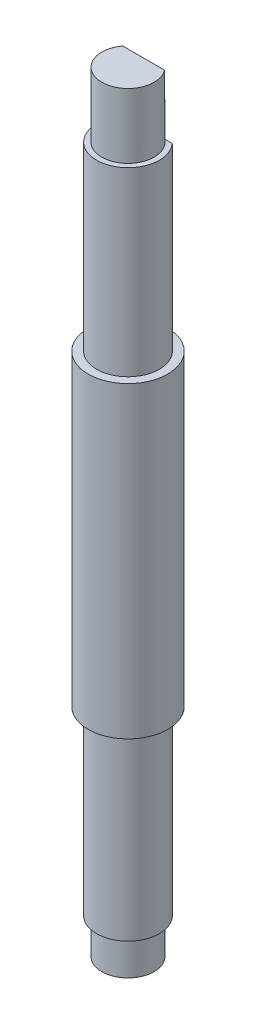
ISO-10303-21;
HEADER;
FILE_DESCRIPTION(('STEP AP214'),'2;1');
FILE_NAME('part.step','',(''),(''),'','','');
FILE_SCHEMA(('AUTOMOTIVE_DESIGN { 1 0 10303 214 1 1 1 1 }'));
ENDSEC;
DATA;
#1=APPLICATION_CONTEXT('core data for automotive mechanical design processes');
#2=APPLICATION_PROTOCOL_DEFINITION('international standard','automotive_design',2000,#1);
#3=PRODUCT_CONTEXT('',#1,'mechanical');
#4=PRODUCT('Part','Part','',(#3));
#5=PRODUCT_RELATED_PRODUCT_CATEGORY('part','',(#4));
#6=PRODUCT_DEFINITION_FORMATION('','',#4);
#7=PRODUCT_DEFINITION_CONTEXT('part definition',#1,'design');
#8=PRODUCT_DEFINITION('design','',#6,#7);
#9=PRODUCT_DEFINITION_SHAPE('','',#8);
#10=(LENGTH_UNIT() NAMED_UNIT(*) SI_UNIT(.MILLI.,.METRE.));
#11=(NAMED_UNIT(*) PLANE_ANGLE_UNIT() SI_UNIT($,.RADIAN.));
#12=(NAMED_UNIT(*) SI_UNIT($,.STERADIAN.) SOLID_ANGLE_UNIT());
#13=UNCERTAINTY_MEASURE_WITH_UNIT(LENGTH_MEASURE(1.E-05),#10,'distance_accuracy_value','');
#14=(GEOMETRIC_REPRESENTATION_CONTEXT(3) GLOBAL_UNCERTAINTY_ASSIGNED_CONTEXT((#13)) GLOBAL_UNIT_ASSIGNED_CONTEXT((#10,
#11,#12)) REPRESENTATION_CONTEXT('',''));
#15=CARTESIAN_POINT('',(0.,0.,0.));
#16=DIRECTION('',(0.,0.,1.));
#17=DIRECTION('',(1.,0.,0.));
#18=AXIS2_PLACEMENT_3D('',#15,#16,#17);
#19=CARTESIAN_POINT('',(-1.11803398874989,-8.08600449930836,-1.));
#20=DIRECTION('',(0.,0.,1.));
#21=DIRECTION('',(1.,0.,0.));
#22=AXIS2_PLACEMENT_3D('',#19,#20,#21);
#23=PLANE('',#22);
#24=DIRECTION('',(-1.,0.,0.));
#25=VECTOR('',#24,1.);
#26=CARTESIAN_POINT('',(-1.1180339887499,4.55528334816956,-1.));
#27=LINE('',#26,#25);
#28=CARTESIAN_POINT('',(0.75,4.55528334816956,-1.));
#29=VERTEX_POINT('',#28);
#30=CARTESIAN_POINT('',(-0.749999999999999,4.55528334816956,-1.));
#31=VERTEX_POINT('',#30);
#32=EDGE_CURVE('E12',#29,#31,#27,.T.);
#33=ORIENTED_EDGE('',*,*,#32,.F.);
#34=DIRECTION('',(0.,1.,0.));
#35=VECTOR('',#34,1.);
#36=CARTESIAN_POINT('',(0.75,5.95528334816956,-1.));
#37=LINE('',#36,#35);
#38=CARTESIAN_POINT('',(0.75,2.85528334816956,-1.));
#39=VERTEX_POINT('',#38);
#40=EDGE_CURVE('E164',#29,#39,#37,.F.);
#41=ORIENTED_EDGE('',*,*,#40,.T.);
#42=DIRECTION('',(-1.,0.,0.));
#43=VECTOR('',#42,1.);
#44=CARTESIAN_POINT('',(0.,2.85528334816956,-1.));
#45=LINE('',#44,#43);
#46=CARTESIAN_POINT('',(1.11803398874989,2.85528334816956,-1.));
#47=VERTEX_POINT('',#46);
#48=EDGE_CURVE('E165',#47,#39,#45,.T.);
#49=ORIENTED_EDGE('',*,*,#48,.F.);
#50=DIRECTION('',(0.,1.,0.));
#51=VECTOR('',#50,1.);
#52=CARTESIAN_POINT('',(1.1180339887499,-8.08600449930836,-1.));
#53=LINE('',#52,#51);
#54=CARTESIAN_POINT('',(1.1180339887499,-5.79471665183044,-1.));
#55=VERTEX_POINT('',#54);
#56=EDGE_CURVE('E153',#55,#47,#53,.T.);
#57=ORIENTED_EDGE('',*,*,#56,.F.);
#58=DIRECTION('',(-1.,0.,0.));
#59=VECTOR('',#58,1.);
#60=CARTESIAN_POINT('',(-1.11803398874989,-5.79471665183044,-1.));
#61=LINE('',#60,#59);
#62=CARTESIAN_POINT('',(-1.1180339887499,-5.79471665183044,-1.));
#63=VERTEX_POINT('',#62);
#64=EDGE_CURVE('E156',#55,#63,#61,.T.);
#65=ORIENTED_EDGE('',*,*,#64,.T.);
#66=DIRECTION('',(0.,1.,0.));
#67=VECTOR('',#66,1.);
#68=CARTESIAN_POINT('',(-1.11803398874989,-8.08600449930836,-1.));
#69=LINE('',#68,#67);
#70=CARTESIAN_POINT('',(-1.1180339887499,2.85528334816956,-1.));
#71=VERTEX_POINT('',#70);
#72=EDGE_CURVE('E152',#63,#71,#69,.T.);
#73=ORIENTED_EDGE('',*,*,#72,.T.);
#74=CARTESIAN_POINT('',(-0.75,2.85528334816956,-1.));
#75=VERTEX_POINT('',#74);
#76=EDGE_CURVE('E161',#75,#71,#45,.T.);
#77=ORIENTED_EDGE('',*,*,#76,.F.);
#78=DIRECTION('',(0.,1.,0.));
#79=VECTOR('',#78,1.);
#80=CARTESIAN_POINT('',(-0.75,5.95528334816956,-1.));
#81=LINE('',#80,#79);
#82=EDGE_CURVE('E159',#75,#31,#81,.T.);
#83=ORIENTED_EDGE('',*,*,#82,.T.);
#84=EDGE_LOOP('',(#33,#41,#49,#57,#65,#73,#77,#83));
#85=FACE_BOUND('',#84,.T.);
#86=ADVANCED_FACE('F37',(#85),#23,.F.);
#87=CARTESIAN_POINT('',(0.,5.95528334816956,0.));
#88=DIRECTION('',(0.,1.,0.));
#89=DIRECTION('',(-1.,0.,0.));
#90=AXIS2_PLACEMENT_3D('',#87,#88,#89);
#91=CYLINDRICAL_SURFACE('',#90,1.5);
#92=CARTESIAN_POINT('',(0.,-20.4947166518304,0.));
#93=DIRECTION('',(0.,1.,0.));
#94=DIRECTION('',(-1.,0.,0.));
#95=AXIS2_PLACEMENT_3D('',#92,#93,#94);
#96=CIRCLE('',#95,1.5);
#97=CARTESIAN_POINT('',(-1.11803398874989,-20.4947166518304,-0.999999999999999));
#98=VERTEX_POINT('',#97);
#99=CARTESIAN_POINT('',(1.1180339887499,-20.4947166518304,-1.));
#100=VERTEX_POINT('',#99);
#101=EDGE_CURVE('E192',#98,#100,#96,.T.);
#102=ORIENTED_EDGE('',*,*,#101,.F.);
#103=DIRECTION('',(0.,-1.,0.));
#104=VECTOR('',#103,1.);
#105=CARTESIAN_POINT('',(-1.11803398874989,-18.2034288043525,-1.));
#106=LINE('',#105,#104);
#107=CARTESIAN_POINT('',(-1.11803398874989,-29.1447166518304,-1.));
#108=VERTEX_POINT('',#107);
#109=EDGE_CURVE('E143',#98,#108,#106,.T.);
#110=ORIENTED_EDGE('',*,*,#109,.T.);
#111=CARTESIAN_POINT('',(0.,-29.1447166518304,0.));
#112=DIRECTION('',(0.,1.,0.));
#113=DIRECTION('',(-1.,0.,0.));
#114=AXIS2_PLACEMENT_3D('',#111,#112,#113);
#115=CIRCLE('',#114,1.5);
#116=CARTESIAN_POINT('',(1.1180339887499,-29.1447166518304,-1.));
#117=VERTEX_POINT('',#116);
#118=EDGE_CURVE('E167',#108,#117,#115,.T.);
#119=ORIENTED_EDGE('',*,*,#118,.T.);
#120=DIRECTION('',(0.,-1.,0.));
#121=VECTOR('',#120,1.);
#122=CARTESIAN_POINT('',(1.1180339887499,-18.2034288043525,-1.));
#123=LINE('',#122,#121);
#124=EDGE_CURVE('E59',#100,#117,#123,.T.);
#125=ORIENTED_EDGE('',*,*,#124,.F.);
#126=EDGE_LOOP('',(#102,#110,#119,#125));
#127=FACE_BOUND('',#126,.T.);
#128=ADVANCED_FACE('F39',(#127),#91,.T.);
#129=CARTESIAN_POINT('',(0.,-30.8447166518304,0.));
#130=DIRECTION('',(0.,-1.,0.));
#131=DIRECTION('',(1.,0.,0.));
#132=AXIS2_PLACEMENT_3D('',#129,#130,#131);
#133=PLANE('',#132);
#134=CARTESIAN_POINT('',(0.,-30.8447166518304,0.));
#135=DIRECTION('',(0.,1.,0.));
#136=DIRECTION('',(-1.,0.,0.));
#137=AXIS2_PLACEMENT_3D('',#134,#135,#136);
#138=CIRCLE('',#137,1.25);
#139=CARTESIAN_POINT('',(-0.749999999999995,-30.8447166518304,-1.));
#140=VERTEX_POINT('',#139);
#141=CARTESIAN_POINT('',(0.750000000000004,-30.8447166518304,-1.));
#142=VERTEX_POINT('',#141);
#143=EDGE_CURVE('E173',#140,#142,#138,.T.);
#144=ORIENTED_EDGE('',*,*,#143,.F.);
#145=DIRECTION('',(1.,0.,0.));
#146=VECTOR('',#145,1.);
#147=CARTESIAN_POINT('',(0.,-30.8447166518304,-1.));
#148=LINE('',#147,#146);
#149=EDGE_CURVE('E134',#140,#142,#148,.T.);
#150=ORIENTED_EDGE('',*,*,#149,.T.);
#151=EDGE_LOOP('',(#144,#150));
#152=FACE_BOUND('',#151,.T.);
#153=ADVANCED_FACE('F206',(#152),#133,.T.);
#154=CARTESIAN_POINT('',(0.,5.95528334816956,0.));
#155=DIRECTION('',(0.,1.,0.));
#156=DIRECTION('',(-1.,0.,0.));
#157=AXIS2_PLACEMENT_3D('',#154,#155,#156);
#158=CYLINDRICAL_SURFACE('',#157,1.25);
#159=CARTESIAN_POINT('',(0.,-29.1447166518304,0.));
#160=DIRECTION('',(0.,1.,0.));
#161=DIRECTION('',(-1.,0.,0.));
#162=AXIS2_PLACEMENT_3D('',#159,#160,#161);
#163=CIRCLE('',#162,1.25);
#164=CARTESIAN_POINT('',(-0.749999999999996,-29.1447166518304,-1.));
#165=VERTEX_POINT('',#164);
#166=CARTESIAN_POINT('',(0.750000000000005,-29.1447166518304,-1.));
#167=VERTEX_POINT('',#166);
#168=EDGE_CURVE('E170',#165,#167,#163,.T.);
#169=ORIENTED_EDGE('',*,*,#168,.F.);
#170=DIRECTION('',(0.,1.,0.));
#171=VECTOR('',#170,1.);
#172=CARTESIAN_POINT('',(-0.75,5.95528334816956,-1.));
#173=LINE('',#172,#171);
#174=EDGE_CURVE('E149',#165,#140,#173,.F.);
#175=ORIENTED_EDGE('',*,*,#174,.T.);
#176=ORIENTED_EDGE('',*,*,#143,.T.);
#177=DIRECTION('',(0.,1.,0.));
#178=VECTOR('',#177,1.);
#179=CARTESIAN_POINT('',(0.75,5.95528334816956,-1.));
#180=LINE('',#179,#178);
#181=EDGE_CURVE('E140',#142,#167,#180,.T.);
#182=ORIENTED_EDGE('',*,*,#181,.T.);
#183=EDGE_LOOP('',(#169,#175,#176,#182));
#184=FACE_BOUND('',#183,.T.);
#185=ADVANCED_FACE('F202',(#184),#158,.T.);
#186=CARTESIAN_POINT('',(0.,-29.1447166518304,0.));
#187=DIRECTION('',(0.,-1.,0.));
#188=DIRECTION('',(1.,0.,0.));
#189=AXIS2_PLACEMENT_3D('',#186,#187,#188);
#190=PLANE('',#189);
#191=ORIENTED_EDGE('',*,*,#118,.F.);
#192=DIRECTION('',(1.,0.,0.));
#193=VECTOR('',#192,1.);
#194=CARTESIAN_POINT('',(0.,-29.1447166518304,-1.));
#195=LINE('',#194,#193);
#196=EDGE_CURVE('E45',#108,#165,#195,.T.);
#197=ORIENTED_EDGE('',*,*,#196,.T.);
#198=ORIENTED_EDGE('',*,*,#168,.T.);
#199=EDGE_CURVE('E194',#167,#117,#195,.T.);
#200=ORIENTED_EDGE('',*,*,#199,.T.);
#201=EDGE_LOOP('',(#191,#197,#198,#200));
#202=FACE_BOUND('',#201,.T.);
#203=ADVANCED_FACE('F199',(#202),#190,.T.);
#204=CARTESIAN_POINT('',(0.,-20.4947166518304,0.));
#205=DIRECTION('',(0.,-1.,0.));
#206=DIRECTION('',(1.,0.,0.));
#207=AXIS2_PLACEMENT_3D('',#204,#205,#206);
#208=PLANE('',#207);
#209=ORIENTED_EDGE('',*,*,#101,.T.);
#210=DIRECTION('',(-1.,0.,0.));
#211=VECTOR('',#210,1.);
#212=CARTESIAN_POINT('',(0.,-20.4947166518304,-1.));
#213=LINE('',#212,#211);
#214=EDGE_CURVE('E138',#100,#98,#213,.T.);
#215=ORIENTED_EDGE('',*,*,#214,.T.);
#216=EDGE_LOOP('',(#209,#215));
#217=FACE_BOUND('',#216,.T.);
#218=CARTESIAN_POINT('',(0.,-20.4947166518304,0.));
#219=DIRECTION('',(0.,1.,0.));
#220=DIRECTION('',(-1.,0.,0.));
#221=AXIS2_PLACEMENT_3D('',#218,#219,#220);
#222=CIRCLE('',#221,1.9);
#223=CARTESIAN_POINT('',(-1.9,-20.4947166518304,0.));
#224=VERTEX_POINT('',#223);
#225=EDGE_CURVE('E189',#224,#224,#222,.T.);
#226=ORIENTED_EDGE('',*,*,#225,.F.);
#227=EDGE_LOOP('',(#226));
#228=FACE_BOUND('',#227,.T.);
#229=ADVANCED_FACE('F225',(#217,#228),#208,.T.);
#230=CARTESIAN_POINT('',(0.,5.95528334816956,0.));
#231=DIRECTION('',(0.,1.,0.));
#232=DIRECTION('',(-1.,0.,0.));
#233=AXIS2_PLACEMENT_3D('',#230,#231,#232);
#234=CYLINDRICAL_SURFACE('',#233,1.9);
#235=ORIENTED_EDGE('',*,*,#225,.T.);
#236=EDGE_LOOP('',(#235));
#237=FACE_BOUND('',#236,.T.);
#238=CARTESIAN_POINT('',(0.,-5.79471665183044,0.));
#239=DIRECTION('',(0.,1.,0.));
#240=DIRECTION('',(-1.,0.,0.));
#241=AXIS2_PLACEMENT_3D('',#238,#239,#240);
#242=CIRCLE('',#241,1.9);
#243=CARTESIAN_POINT('',(-1.9,-5.79471665183044,0.));
#244=VERTEX_POINT('',#243);
#245=EDGE_CURVE('E186',#244,#244,#242,.T.);
#246=ORIENTED_EDGE('',*,*,#245,.F.);
#247=EDGE_LOOP('',(#246));
#248=FACE_BOUND('',#247,.T.);
#249=ADVANCED_FACE('F229',(#237,#248),#234,.T.);
#250=CARTESIAN_POINT('',(0.,-5.79471665183044,0.));
#251=DIRECTION('',(0.,1.,0.));
#252=DIRECTION('',(-1.,0.,0.));
#253=AXIS2_PLACEMENT_3D('',#250,#251,#252);
#254=PLANE('',#253);
#255=ORIENTED_EDGE('',*,*,#245,.T.);
#256=EDGE_LOOP('',(#255));
#257=FACE_BOUND('',#256,.T.);
#258=CARTESIAN_POINT('',(0.,-5.79471665183044,0.));
#259=DIRECTION('',(0.,1.,0.));
#260=DIRECTION('',(-1.,0.,0.));
#261=AXIS2_PLACEMENT_3D('',#258,#259,#260);
#262=CIRCLE('',#261,1.5);
#263=EDGE_CURVE('E183',#63,#55,#262,.T.);
#264=ORIENTED_EDGE('',*,*,#263,.F.);
#265=ORIENTED_EDGE('',*,*,#64,.F.);
#266=EDGE_LOOP('',(#264,#265));
#267=FACE_BOUND('',#266,.T.);
#268=ADVANCED_FACE('F234',(#257,#267),#254,.T.);
#269=CARTESIAN_POINT('',(0.,5.95528334816956,0.));
#270=DIRECTION('',(0.,1.,0.));
#271=DIRECTION('',(-1.,0.,0.));
#272=AXIS2_PLACEMENT_3D('',#269,#270,#271);
#273=CYLINDRICAL_SURFACE('',#272,1.5);
#274=ORIENTED_EDGE('',*,*,#56,.T.);
#275=CARTESIAN_POINT('',(0.,2.85528334816956,0.));
#276=DIRECTION('',(0.,1.,0.));
#277=DIRECTION('',(-1.,0.,0.));
#278=AXIS2_PLACEMENT_3D('',#275,#276,#277);
#279=CIRCLE('',#278,1.5);
#280=EDGE_CURVE('E180',#71,#47,#279,.T.);
#281=ORIENTED_EDGE('',*,*,#280,.F.);
#282=ORIENTED_EDGE('',*,*,#72,.F.);
#283=ORIENTED_EDGE('',*,*,#263,.T.);
#284=EDGE_LOOP('',(#274,#281,#282,#283));
#285=FACE_BOUND('',#284,.T.);
#286=ADVANCED_FACE('F241',(#285),#273,.T.);
#287=CARTESIAN_POINT('',(0.,2.85528334816956,0.));
#288=DIRECTION('',(0.,-1.,0.));
#289=DIRECTION('',(1.,0.,0.));
#290=AXIS2_PLACEMENT_3D('',#287,#288,#289);
#291=PLANE('',#290);
#292=ORIENTED_EDGE('',*,*,#280,.T.);
#293=ORIENTED_EDGE('',*,*,#48,.T.);
#294=CARTESIAN_POINT('',(0.,2.85528334816956,0.));
#295=DIRECTION('',(0.,1.,0.));
#296=DIRECTION('',(-1.,0.,0.));
#297=AXIS2_PLACEMENT_3D('',#294,#295,#296);
#298=CIRCLE('',#297,1.25);
#299=EDGE_CURVE('E177',#75,#39,#298,.T.);
#300=ORIENTED_EDGE('',*,*,#299,.F.);
#301=ORIENTED_EDGE('',*,*,#76,.T.);
#302=EDGE_LOOP('',(#292,#293,#300,#301));
#303=FACE_BOUND('',#302,.T.);
#304=ADVANCED_FACE('F245',(#303),#291,.F.);
#305=CARTESIAN_POINT('',(0.,5.95528334816956,0.));
#306=DIRECTION('',(0.,1.,0.));
#307=DIRECTION('',(-1.,0.,0.));
#308=AXIS2_PLACEMENT_3D('',#305,#306,#307);
#309=CYLINDRICAL_SURFACE('',#308,1.25);
#310=DIRECTION('',(0.,1.,0.));
#311=VECTOR('',#310,1.);
#312=CARTESIAN_POINT('',(-0.999999999999999,4.55528334816956,-0.75));
#313=LINE('',#312,#311);
#314=CARTESIAN_POINT('',(-0.999999999999999,4.55528334816956,-0.75));
#315=VERTEX_POINT('',#314);
#316=CARTESIAN_POINT('',(-1.,5.95528334816956,-0.75));
#317=VERTEX_POINT('',#316);
#318=EDGE_CURVE('E124',#315,#317,#313,.T.);
#319=ORIENTED_EDGE('',*,*,#318,.F.);
#320=CARTESIAN_POINT('',(0.,4.55528334816956,0.));
#321=DIRECTION('',(0.,1.,0.));
#322=DIRECTION('',(-1.,0.,0.));
#323=AXIS2_PLACEMENT_3D('',#320,#321,#322);
#324=CIRCLE('',#323,1.25);
#325=EDGE_CURVE('E112',#31,#315,#324,.T.);
#326=ORIENTED_EDGE('',*,*,#325,.F.);
#327=ORIENTED_EDGE('',*,*,#82,.F.);
#328=ORIENTED_EDGE('',*,*,#299,.T.);
#329=ORIENTED_EDGE('',*,*,#40,.F.);
#330=CARTESIAN_POINT('',(0.999999999999999,4.55528334816956,-0.75));
#331=VERTEX_POINT('',#330);
#332=EDGE_CURVE('E51',#331,#29,#324,.T.);
#333=ORIENTED_EDGE('',*,*,#332,.F.);
#334=DIRECTION('',(0.,1.,0.));
#335=VECTOR('',#334,1.);
#336=CARTESIAN_POINT('',(0.999999999999999,4.55528334816956,-0.75));
#337=LINE('',#336,#335);
#338=CARTESIAN_POINT('',(0.999999999999998,5.95528334816956,-0.75));
#339=VERTEX_POINT('',#338);
#340=EDGE_CURVE('E127',#331,#339,#337,.T.);
#341=ORIENTED_EDGE('',*,*,#340,.T.);
#342=CARTESIAN_POINT('',(0.,5.95528334816956,0.));
#343=DIRECTION('',(0.,1.,0.));
#344=DIRECTION('',(-1.,0.,0.));
#345=AXIS2_PLACEMENT_3D('',#342,#343,#344);
#346=CIRCLE('',#345,1.25);
#347=EDGE_CURVE('E132',#317,#339,#346,.T.);
#348=ORIENTED_EDGE('',*,*,#347,.F.);
#349=EDGE_LOOP('',(#319,#326,#327,#328,#329,#333,#341,#348));
#350=FACE_BOUND('',#349,.T.);
#351=ADVANCED_FACE('F130',(#350),#309,.T.);
#352=CARTESIAN_POINT('',(0.,5.95528334816956,0.));
#353=DIRECTION('',(0.,-1.,0.));
#354=DIRECTION('',(1.,0.,0.));
#355=AXIS2_PLACEMENT_3D('',#352,#353,#354);
#356=PLANE('',#355);
#357=ORIENTED_EDGE('',*,*,#347,.T.);
#358=DIRECTION('',(1.,0.,0.));
#359=VECTOR('',#358,1.);
#360=CARTESIAN_POINT('',(-1.,5.95528334816956,-0.75));
#361=LINE('',#360,#359);
#362=EDGE_CURVE('E120',#317,#339,#361,.T.);
#363=ORIENTED_EDGE('',*,*,#362,.F.);
#364=EDGE_LOOP('',(#357,#363));
#365=FACE_BOUND('',#364,.T.);
#366=ADVANCED_FACE('F251',(#365),#356,.F.);
#367=CARTESIAN_POINT('',(0.,-18.2034288043525,-1.));
#368=DIRECTION('',(0.,0.,-1.));
#369=DIRECTION('',(-1.,0.,0.));
#370=AXIS2_PLACEMENT_3D('',#367,#368,#369);
#371=PLANE('',#370);
#372=ORIENTED_EDGE('',*,*,#196,.F.);
#373=ORIENTED_EDGE('',*,*,#109,.F.);
#374=ORIENTED_EDGE('',*,*,#214,.F.);
#375=ORIENTED_EDGE('',*,*,#124,.T.);
#376=ORIENTED_EDGE('',*,*,#199,.F.);
#377=ORIENTED_EDGE('',*,*,#181,.F.);
#378=ORIENTED_EDGE('',*,*,#149,.F.);
#379=ORIENTED_EDGE('',*,*,#174,.F.);
#380=EDGE_LOOP('',(#372,#373,#374,#375,#376,#377,#378,#379));
#381=FACE_BOUND('',#380,.T.);
#382=ADVANCED_FACE('F204',(#381),#371,.T.);
#383=CARTESIAN_POINT('',(0.,4.55528334816956,0.));
#384=DIRECTION('',(0.,1.,0.));
#385=DIRECTION('',(-1.,0.,0.));
#386=AXIS2_PLACEMENT_3D('',#383,#384,#385);
#387=PLANE('',#386);
#388=ORIENTED_EDGE('',*,*,#32,.T.);
#389=ORIENTED_EDGE('',*,*,#325,.T.);
#390=DIRECTION('',(1.,0.,0.));
#391=VECTOR('',#390,1.);
#392=CARTESIAN_POINT('',(-0.999999999999999,4.55528334816956,-0.75));
#393=LINE('',#392,#391);
#394=EDGE_CURVE('E115',#315,#331,#393,.T.);
#395=ORIENTED_EDGE('',*,*,#394,.T.);
#396=ORIENTED_EDGE('',*,*,#332,.T.);
#397=EDGE_LOOP('',(#388,#389,#395,#396));
#398=FACE_BOUND('',#397,.T.);
#399=ADVANCED_FACE('F114',(#398),#387,.T.);
#400=CARTESIAN_POINT('',(-0.999999999999999,4.55528334816956,-0.75));
#401=DIRECTION('',(0.,0.,1.));
#402=DIRECTION('',(1.,0.,0.));
#403=AXIS2_PLACEMENT_3D('',#400,#401,#402);
#404=PLANE('',#403);
#405=ORIENTED_EDGE('',*,*,#362,.T.);
#406=ORIENTED_EDGE('',*,*,#340,.F.);
#407=ORIENTED_EDGE('',*,*,#394,.F.);
#408=ORIENTED_EDGE('',*,*,#318,.T.);
#409=EDGE_LOOP('',(#405,#406,#407,#408));
#410=FACE_BOUND('',#409,.T.);
#411=ADVANCED_FACE('F123',(#410),#404,.F.);
#412=CLOSED_SHELL('',(#86,#128,#153,#185,#203,#229,#249,#268,#286,#304,#351,#366,#382,#399,#411));
#413=MANIFOLD_SOLID_BREP('B2',#412);
#414=ADVANCED_BREP_SHAPE_REPRESENTATION('',(#18,#413),#14);
#415=SHAPE_DEFINITION_REPRESENTATION(#9,#414);
ENDSEC;
END-ISO-10303-21;
